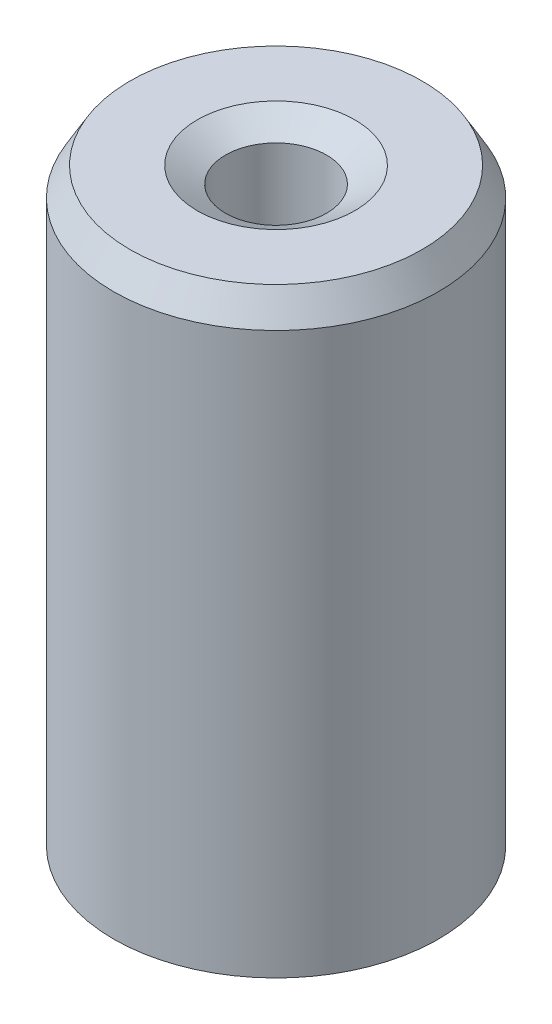
ISO-10303-21;
HEADER;
FILE_DESCRIPTION(('STEP AP214'),'2;1');
FILE_NAME('part.step','',(''),(''),'','','');
FILE_SCHEMA(('AUTOMOTIVE_DESIGN { 1 0 10303 214 1 1 1 1 }'));
ENDSEC;
DATA;
#1=APPLICATION_CONTEXT('core data for automotive mechanical design processes');
#2=APPLICATION_PROTOCOL_DEFINITION('international standard','automotive_design',2000,#1);
#3=PRODUCT_CONTEXT('',#1,'mechanical');
#4=PRODUCT('Part','Part','',(#3));
#5=PRODUCT_RELATED_PRODUCT_CATEGORY('part','',(#4));
#6=PRODUCT_DEFINITION_FORMATION('','',#4);
#7=PRODUCT_DEFINITION_CONTEXT('part definition',#1,'design');
#8=PRODUCT_DEFINITION('design','',#6,#7);
#9=PRODUCT_DEFINITION_SHAPE('','',#8);
#10=(LENGTH_UNIT() NAMED_UNIT(*) SI_UNIT(.MILLI.,.METRE.));
#11=(NAMED_UNIT(*) PLANE_ANGLE_UNIT() SI_UNIT($,.RADIAN.));
#12=(NAMED_UNIT(*) SI_UNIT($,.STERADIAN.) SOLID_ANGLE_UNIT());
#13=UNCERTAINTY_MEASURE_WITH_UNIT(LENGTH_MEASURE(1.E-05),#10,'distance_accuracy_value','');
#14=(GEOMETRIC_REPRESENTATION_CONTEXT(3) GLOBAL_UNCERTAINTY_ASSIGNED_CONTEXT((#13)) GLOBAL_UNIT_ASSIGNED_CONTEXT((#10,
#11,#12)) REPRESENTATION_CONTEXT('',''));
#15=CARTESIAN_POINT('',(0.,0.,0.));
#16=DIRECTION('',(0.,0.,1.));
#17=DIRECTION('',(1.,0.,0.));
#18=AXIS2_PLACEMENT_3D('',#15,#16,#17);
#19=CARTESIAN_POINT('',(0.,27.955865125189,0.));
#20=DIRECTION('',(0.,-1.,0.));
#21=DIRECTION('',(0.,0.,-1.));
#22=AXIS2_PLACEMENT_3D('',#19,#20,#21);
#23=CYLINDRICAL_SURFACE('',#22,7.5);
#24=CARTESIAN_POINT('',(0.,0.754693769713603,0.));
#25=DIRECTION('',(0.,1.,0.));
#26=DIRECTION('',(0.,0.,1.));
#27=AXIS2_PLACEMENT_3D('',#24,#25,#26);
#28=CIRCLE('',#27,7.5);
#29=CARTESIAN_POINT('',(0.,0.754693769713603,7.5));
#30=VERTEX_POINT('',#29);
#31=EDGE_CURVE('E10',#30,#30,#28,.T.);
#32=ORIENTED_EDGE('',*,*,#31,.T.);
#33=EDGE_LOOP('',(#32));
#34=FACE_BOUND('',#33,.T.);
#35=CARTESIAN_POINT('',(0.,26.6486971718894,0.));
#36=DIRECTION('',(0.,1.,0.));
#37=DIRECTION('',(0.,0.,1.));
#38=AXIS2_PLACEMENT_3D('',#35,#36,#37);
#39=CIRCLE('',#38,7.5);
#40=CARTESIAN_POINT('',(0.,26.6486971718894,7.5));
#41=VERTEX_POINT('',#40);
#42=EDGE_CURVE('E50',#41,#41,#39,.F.);
#43=ORIENTED_EDGE('',*,*,#42,.T.);
#44=EDGE_LOOP('',(#43));
#45=FACE_BOUND('',#44,.T.);
#46=ADVANCED_FACE('F39',(#34,#45),#23,.T.);
#47=CARTESIAN_POINT('',(0.,27.955865125189,0.));
#48=DIRECTION('',(0.,1.,0.));
#49=DIRECTION('',(0.,0.,1.));
#50=AXIS2_PLACEMENT_3D('',#47,#48,#49);
#51=PLANE('',#50);
#52=CARTESIAN_POINT('',(0.,27.955865125189,0.));
#53=DIRECTION('',(0.,1.,0.));
#54=DIRECTION('',(0.,0.,1.));
#55=AXIS2_PLACEMENT_3D('',#52,#53,#54);
#56=CIRCLE('',#55,3.63908635866597);
#57=CARTESIAN_POINT('',(0.,27.955865125189,3.63908635866597));
#58=VERTEX_POINT('',#57);
#59=EDGE_CURVE('E58',#58,#58,#56,.F.);
#60=ORIENTED_EDGE('',*,*,#59,.T.);
#61=EDGE_LOOP('',(#60));
#62=FACE_BOUND('',#61,.T.);
#63=CARTESIAN_POINT('',(0.,27.955865125189,0.));
#64=DIRECTION('',(0.,1.,0.));
#65=DIRECTION('',(0.,0.,1.));
#66=AXIS2_PLACEMENT_3D('',#63,#64,#65);
#67=CIRCLE('',#66,6.7453062302864);
#68=CARTESIAN_POINT('',(0.,27.955865125189,6.7453062302864));
#69=VERTEX_POINT('',#68);
#70=EDGE_CURVE('E61',#69,#69,#67,.T.);
#71=ORIENTED_EDGE('',*,*,#70,.T.);
#72=EDGE_LOOP('',(#71));
#73=FACE_BOUND('',#72,.T.);
#74=ADVANCED_FACE('F88',(#62,#73),#51,.T.);
#75=CARTESIAN_POINT('',(0.,0.,0.));
#76=DIRECTION('',(0.,1.,0.));
#77=DIRECTION('',(0.,0.,1.));
#78=AXIS2_PLACEMENT_3D('',#75,#76,#77);
#79=PLANE('',#78);
#80=CARTESIAN_POINT('',(0.,0.,0.));
#81=DIRECTION('',(0.,1.,0.));
#82=DIRECTION('',(0.,0.,1.));
#83=AXIS2_PLACEMENT_3D('',#80,#81,#82);
#84=CIRCLE('',#83,3.08661217507992);
#85=CARTESIAN_POINT('',(0.,0.,3.08661217507992));
#86=VERTEX_POINT('',#85);
#87=EDGE_CURVE('E51',#86,#86,#84,.T.);
#88=ORIENTED_EDGE('',*,*,#87,.T.);
#89=EDGE_LOOP('',(#88));
#90=FACE_BOUND('',#89,.T.);
#91=CARTESIAN_POINT('',(0.,0.,0.));
#92=DIRECTION('',(0.,1.,0.));
#93=DIRECTION('',(0.,0.,1.));
#94=AXIS2_PLACEMENT_3D('',#91,#92,#93);
#95=CIRCLE('',#94,6.19283204670034);
#96=CARTESIAN_POINT('',(0.,0.,6.19283204670034));
#97=VERTEX_POINT('',#96);
#98=EDGE_CURVE('E54',#97,#97,#95,.F.);
#99=ORIENTED_EDGE('',*,*,#98,.T.);
#100=EDGE_LOOP('',(#99));
#101=FACE_BOUND('',#100,.T.);
#102=ADVANCED_FACE('F83',(#90,#101),#79,.F.);
#103=CARTESIAN_POINT('',(0.,27.955865125189,0.));
#104=DIRECTION('',(0.,-1.,0.));
#105=DIRECTION('',(0.,0.,-1.));
#106=AXIS2_PLACEMENT_3D('',#103,#104,#105);
#107=CYLINDRICAL_SURFACE('',#106,2.33191840536631);
#108=CARTESIAN_POINT('',(0.,27.2011713554754,0.));
#109=DIRECTION('',(0.,1.,0.));
#110=DIRECTION('',(0.,0.,1.));
#111=AXIS2_PLACEMENT_3D('',#108,#109,#110);
#112=CIRCLE('',#111,2.33191840536631);
#113=CARTESIAN_POINT('',(0.,27.2011713554754,2.33191840536631));
#114=VERTEX_POINT('',#113);
#115=EDGE_CURVE('E67',#114,#114,#112,.T.);
#116=ORIENTED_EDGE('',*,*,#115,.T.);
#117=EDGE_LOOP('',(#116));
#118=FACE_BOUND('',#117,.T.);
#119=CARTESIAN_POINT('',(0.,1.30716795329966,0.));
#120=DIRECTION('',(0.,1.,0.));
#121=DIRECTION('',(0.,0.,1.));
#122=AXIS2_PLACEMENT_3D('',#119,#120,#121);
#123=CIRCLE('',#122,2.33191840536631);
#124=CARTESIAN_POINT('',(0.,1.30716795329966,2.33191840536631));
#125=VERTEX_POINT('',#124);
#126=EDGE_CURVE('E69',#125,#125,#123,.F.);
#127=ORIENTED_EDGE('',*,*,#126,.T.);
#128=EDGE_LOOP('',(#127));
#129=FACE_BOUND('',#128,.T.);
#130=ADVANCED_FACE('F71',(#118,#129),#107,.F.);
#131=CARTESIAN_POINT('',(0.,27.2011713554754,0.));
#132=DIRECTION('',(0.,1.,0.));
#133=DIRECTION('',(0.,0.,1.));
#134=AXIS2_PLACEMENT_3D('',#131,#132,#133);
#135=CONICAL_SURFACE('',#134,2.33191840536631,1.0471975511966);
#136=ORIENTED_EDGE('',*,*,#59,.F.);
#137=EDGE_LOOP('',(#136));
#138=FACE_BOUND('',#137,.T.);
#139=ORIENTED_EDGE('',*,*,#115,.F.);
#140=EDGE_LOOP('',(#139));
#141=FACE_BOUND('',#140,.T.);
#142=ADVANCED_FACE('F77',(#138,#141),#135,.F.);
#143=CARTESIAN_POINT('',(0.,0.,0.));
#144=DIRECTION('',(0.,-1.,0.));
#145=DIRECTION('',(0.,0.,-1.));
#146=AXIS2_PLACEMENT_3D('',#143,#144,#145);
#147=CONICAL_SURFACE('',#146,3.08661217507992,0.523598775598297);
#148=ORIENTED_EDGE('',*,*,#126,.F.);
#149=EDGE_LOOP('',(#148));
#150=FACE_BOUND('',#149,.T.);
#151=ORIENTED_EDGE('',*,*,#87,.F.);
#152=EDGE_LOOP('',(#151));
#153=FACE_BOUND('',#152,.T.);
#154=ADVANCED_FACE('F73',(#150,#153),#147,.F.);
#155=CARTESIAN_POINT('',(0.,0.754693769713603,0.));
#156=DIRECTION('',(0.,1.,0.));
#157=DIRECTION('',(0.,0.,1.));
#158=AXIS2_PLACEMENT_3D('',#155,#156,#157);
#159=CONICAL_SURFACE('',#158,7.5,1.0471975511966);
#160=ORIENTED_EDGE('',*,*,#98,.F.);
#161=EDGE_LOOP('',(#160));
#162=FACE_BOUND('',#161,.T.);
#163=ORIENTED_EDGE('',*,*,#31,.F.);
#164=EDGE_LOOP('',(#163));
#165=FACE_BOUND('',#164,.T.);
#166=ADVANCED_FACE('F76',(#162,#165),#159,.T.);
#167=CARTESIAN_POINT('',(0.,27.955865125189,0.));
#168=DIRECTION('',(0.,-1.,0.));
#169=DIRECTION('',(0.,0.,-1.));
#170=AXIS2_PLACEMENT_3D('',#167,#168,#169);
#171=CONICAL_SURFACE('',#170,6.7453062302864,0.523598775598293);
#172=ORIENTED_EDGE('',*,*,#42,.F.);
#173=EDGE_LOOP('',(#172));
#174=FACE_BOUND('',#173,.T.);
#175=ORIENTED_EDGE('',*,*,#70,.F.);
#176=EDGE_LOOP('',(#175));
#177=FACE_BOUND('',#176,.T.);
#178=ADVANCED_FACE('F45',(#174,#177),#171,.T.);
#179=CLOSED_SHELL('',(#46,#74,#102,#130,#142,#154,#166,#178));
#180=MANIFOLD_SOLID_BREP('B2',#179);
#181=ADVANCED_BREP_SHAPE_REPRESENTATION('',(#18,#180),#14);
#182=SHAPE_DEFINITION_REPRESENTATION(#9,#181);
ENDSEC;
END-ISO-10303-21;
